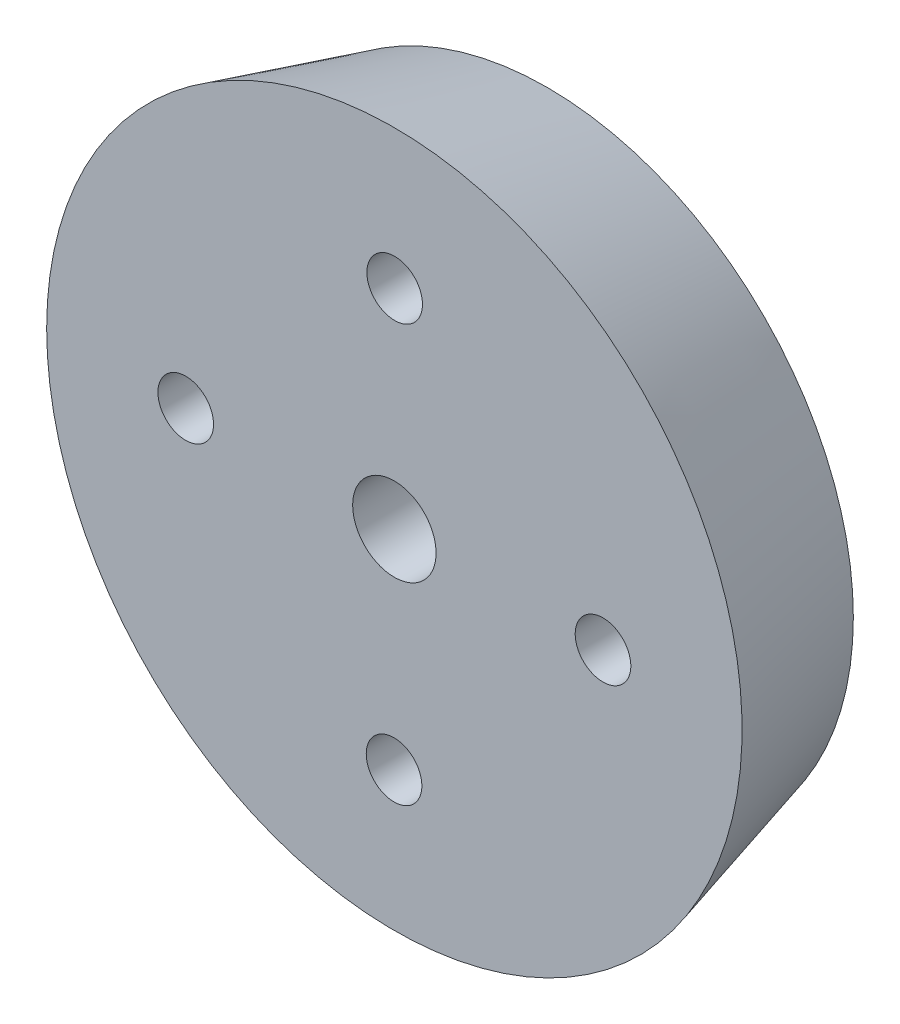
ISO-10303-21;
HEADER;
FILE_DESCRIPTION(('STEP AP214'),'2;1');
FILE_NAME('part.step','',(''),(''),'','','');
FILE_SCHEMA(('AUTOMOTIVE_DESIGN { 1 0 10303 214 1 1 1 1 }'));
ENDSEC;
DATA;
#1=APPLICATION_CONTEXT('core data for automotive mechanical design processes');
#2=APPLICATION_PROTOCOL_DEFINITION('international standard','automotive_design',2000,#1);
#3=PRODUCT_CONTEXT('',#1,'mechanical');
#4=PRODUCT('Part','Part','',(#3));
#5=PRODUCT_RELATED_PRODUCT_CATEGORY('part','',(#4));
#6=PRODUCT_DEFINITION_FORMATION('','',#4);
#7=PRODUCT_DEFINITION_CONTEXT('part definition',#1,'design');
#8=PRODUCT_DEFINITION('design','',#6,#7);
#9=PRODUCT_DEFINITION_SHAPE('','',#8);
#10=(LENGTH_UNIT() NAMED_UNIT(*) SI_UNIT(.MILLI.,.METRE.));
#11=(NAMED_UNIT(*) PLANE_ANGLE_UNIT() SI_UNIT($,.RADIAN.));
#12=(NAMED_UNIT(*) SI_UNIT($,.STERADIAN.) SOLID_ANGLE_UNIT());
#13=UNCERTAINTY_MEASURE_WITH_UNIT(LENGTH_MEASURE(1.E-05),#10,'distance_accuracy_value','');
#14=(GEOMETRIC_REPRESENTATION_CONTEXT(3) GLOBAL_UNCERTAINTY_ASSIGNED_CONTEXT((#13)) GLOBAL_UNIT_ASSIGNED_CONTEXT((#10,
#11,#12)) REPRESENTATION_CONTEXT('',''));
#15=CARTESIAN_POINT('',(0.,0.,0.));
#16=DIRECTION('',(0.,0.,1.));
#17=DIRECTION('',(1.,0.,0.));
#18=AXIS2_PLACEMENT_3D('',#15,#16,#17);
#19=CARTESIAN_POINT('',(25.,0.,-94.));
#20=DIRECTION('',(0.,0.,1.));
#21=DIRECTION('',(1.,0.,0.));
#22=AXIS2_PLACEMENT_3D('',#19,#20,#21);
#23=PLANE('',#22);
#24=CARTESIAN_POINT('',(0.,0.,-94.));
#25=DIRECTION('',(0.,0.,-1.));
#26=DIRECTION('',(-1.,0.,0.));
#27=AXIS2_PLACEMENT_3D('',#24,#25,#26);
#28=CIRCLE('',#27,3.);
#29=CARTESIAN_POINT('',(-3.,0.,-94.));
#30=VERTEX_POINT('',#29);
#31=EDGE_CURVE('E87',#30,#30,#28,.T.);
#32=ORIENTED_EDGE('',*,*,#31,.T.);
#33=EDGE_LOOP('',(#32));
#34=FACE_BOUND('',#33,.T.);
#35=CARTESIAN_POINT('',(0.,0.,-94.));
#36=DIRECTION('',(0.,0.,-1.));
#37=DIRECTION('',(-1.,0.,0.));
#38=AXIS2_PLACEMENT_3D('',#35,#36,#37);
#39=CIRCLE('',#38,25.);
#40=CARTESIAN_POINT('',(-25.,0.,-94.));
#41=VERTEX_POINT('',#40);
#42=EDGE_CURVE('E10',#41,#41,#39,.T.);
#43=ORIENTED_EDGE('',*,*,#42,.F.);
#44=EDGE_LOOP('',(#43));
#45=FACE_BOUND('',#44,.T.);
#46=CARTESIAN_POINT('',(-14.9999825658734,0.0228697068961115,-94.));
#47=DIRECTION('',(0.,0.,-1.));
#48=DIRECTION('',(-1.,0.,0.));
#49=AXIS2_PLACEMENT_3D('',#46,#47,#48);
#50=CIRCLE('',#49,1.99999999999999);
#51=CARTESIAN_POINT('',(-16.9999825658734,0.0228697068961115,-94.));
#52=VERTEX_POINT('',#51);
#53=EDGE_CURVE('E53',#52,#52,#50,.T.);
#54=ORIENTED_EDGE('',*,*,#53,.T.);
#55=EDGE_LOOP('',(#54));
#56=FACE_BOUND('',#55,.T.);
#57=CARTESIAN_POINT('',(0.0228697068961292,14.9999825658734,-94.));
#58=DIRECTION('',(0.,0.,-1.));
#59=DIRECTION('',(-1.,0.,0.));
#60=AXIS2_PLACEMENT_3D('',#57,#58,#59);
#61=CIRCLE('',#60,1.99999999999999);
#62=CARTESIAN_POINT('',(-1.97713029310386,14.9999825658734,-94.));
#63=VERTEX_POINT('',#62);
#64=EDGE_CURVE('E65',#63,#63,#61,.T.);
#65=ORIENTED_EDGE('',*,*,#64,.T.);
#66=EDGE_LOOP('',(#65));
#67=FACE_BOUND('',#66,.T.);
#68=CARTESIAN_POINT('',(-0.0228697068961825,-14.9999825658734,-94.));
#69=DIRECTION('',(0.,0.,-1.));
#70=DIRECTION('',(-1.,0.,0.));
#71=AXIS2_PLACEMENT_3D('',#68,#69,#70);
#72=CIRCLE('',#71,1.99999999999999);
#73=CARTESIAN_POINT('',(-2.02286970689617,-14.9999825658734,-94.));
#74=VERTEX_POINT('',#73);
#75=EDGE_CURVE('E72',#74,#74,#72,.T.);
#76=ORIENTED_EDGE('',*,*,#75,.T.);
#77=EDGE_LOOP('',(#76));
#78=FACE_BOUND('',#77,.T.);
#79=CARTESIAN_POINT('',(14.9999825658734,-0.0228697068961148,-94.));
#80=DIRECTION('',(0.,0.,-1.));
#81=DIRECTION('',(-1.,0.,0.));
#82=AXIS2_PLACEMENT_3D('',#79,#80,#81);
#83=CIRCLE('',#82,1.99999999999999);
#84=CARTESIAN_POINT('',(12.9999825658734,-0.0228697068961148,-94.));
#85=VERTEX_POINT('',#84);
#86=EDGE_CURVE('E79',#85,#85,#83,.T.);
#87=ORIENTED_EDGE('',*,*,#86,.T.);
#88=EDGE_LOOP('',(#87));
#89=FACE_BOUND('',#88,.T.);
#90=ADVANCED_FACE('F38',(#34,#45,#56,#67,#78,#89),#23,.T.);
#91=CARTESIAN_POINT('',(0.,0.,-105.));
#92=DIRECTION('',(0.,0.,1.));
#93=DIRECTION('',(1.,0.,0.));
#94=AXIS2_PLACEMENT_3D('',#91,#92,#93);
#95=CONICAL_SURFACE('',#94,22.,0.266252049150924);
#96=ORIENTED_EDGE('',*,*,#42,.T.);
#97=EDGE_LOOP('',(#96));
#98=FACE_BOUND('',#97,.T.);
#99=CARTESIAN_POINT('',(0.,0.,-105.));
#100=DIRECTION('',(0.,0.,-1.));
#101=DIRECTION('',(-1.,0.,0.));
#102=AXIS2_PLACEMENT_3D('',#99,#100,#101);
#103=CIRCLE('',#102,22.);
#104=CARTESIAN_POINT('',(-22.,0.,-105.));
#105=VERTEX_POINT('',#104);
#106=EDGE_CURVE('E46',#105,#105,#103,.T.);
#107=ORIENTED_EDGE('',*,*,#106,.F.);
#108=EDGE_LOOP('',(#107));
#109=FACE_BOUND('',#108,.T.);
#110=ADVANCED_FACE('F40',(#98,#109),#95,.T.);
#111=CARTESIAN_POINT('',(0.,0.,-105.));
#112=DIRECTION('',(0.,0.,-1.));
#113=DIRECTION('',(-1.,0.,0.));
#114=AXIS2_PLACEMENT_3D('',#111,#112,#113);
#115=PLANE('',#114);
#116=CARTESIAN_POINT('',(0.,0.,-105.));
#117=DIRECTION('',(0.,0.,-1.));
#118=DIRECTION('',(-1.,0.,0.));
#119=AXIS2_PLACEMENT_3D('',#116,#117,#118);
#120=CIRCLE('',#119,3.);
#121=CARTESIAN_POINT('',(-3.,0.,-105.));
#122=VERTEX_POINT('',#121);
#123=EDGE_CURVE('E88',#122,#122,#120,.T.);
#124=ORIENTED_EDGE('',*,*,#123,.F.);
#125=EDGE_LOOP('',(#124));
#126=FACE_BOUND('',#125,.T.);
#127=CARTESIAN_POINT('',(14.9999825658734,-0.0228697068961148,-105.));
#128=DIRECTION('',(0.,0.,-1.));
#129=DIRECTION('',(-1.,0.,0.));
#130=AXIS2_PLACEMENT_3D('',#127,#128,#129);
#131=CIRCLE('',#130,1.99999999999999);
#132=CARTESIAN_POINT('',(12.9999825658734,-0.0228697068961148,-105.));
#133=VERTEX_POINT('',#132);
#134=EDGE_CURVE('E83',#133,#133,#131,.T.);
#135=ORIENTED_EDGE('',*,*,#134,.F.);
#136=EDGE_LOOP('',(#135));
#137=FACE_BOUND('',#136,.T.);
#138=CARTESIAN_POINT('',(-0.0228697068961825,-14.9999825658734,-105.));
#139=DIRECTION('',(0.,0.,-1.));
#140=DIRECTION('',(-1.,0.,0.));
#141=AXIS2_PLACEMENT_3D('',#138,#139,#140);
#142=CIRCLE('',#141,1.99999999999999);
#143=CARTESIAN_POINT('',(-2.02286970689617,-14.9999825658734,-105.));
#144=VERTEX_POINT('',#143);
#145=EDGE_CURVE('E75',#144,#144,#142,.T.);
#146=ORIENTED_EDGE('',*,*,#145,.F.);
#147=EDGE_LOOP('',(#146));
#148=FACE_BOUND('',#147,.T.);
#149=CARTESIAN_POINT('',(0.0228697068961292,14.9999825658734,-105.));
#150=DIRECTION('',(0.,0.,-1.));
#151=DIRECTION('',(-1.,0.,0.));
#152=AXIS2_PLACEMENT_3D('',#149,#150,#151);
#153=CIRCLE('',#152,1.99999999999999);
#154=CARTESIAN_POINT('',(-1.97713029310386,14.9999825658734,-105.));
#155=VERTEX_POINT('',#154);
#156=EDGE_CURVE('E69',#155,#155,#153,.T.);
#157=ORIENTED_EDGE('',*,*,#156,.F.);
#158=EDGE_LOOP('',(#157));
#159=FACE_BOUND('',#158,.T.);
#160=CARTESIAN_POINT('',(-14.9999825658734,0.0228697068961115,-105.));
#161=DIRECTION('',(0.,0.,-1.));
#162=DIRECTION('',(-1.,0.,0.));
#163=AXIS2_PLACEMENT_3D('',#160,#161,#162);
#164=CIRCLE('',#163,1.99999999999999);
#165=CARTESIAN_POINT('',(-16.9999825658734,0.0228697068961115,-105.));
#166=VERTEX_POINT('',#165);
#167=EDGE_CURVE('E60',#166,#166,#164,.T.);
#168=ORIENTED_EDGE('',*,*,#167,.F.);
#169=EDGE_LOOP('',(#168));
#170=FACE_BOUND('',#169,.T.);
#171=ORIENTED_EDGE('',*,*,#106,.T.);
#172=EDGE_LOOP('',(#171));
#173=FACE_BOUND('',#172,.T.);
#174=ADVANCED_FACE('F104',(#126,#137,#148,#159,#170,#173),#115,.T.);
#175=CARTESIAN_POINT('',(-14.9999825658734,0.0228697068961115,-105.));
#176=DIRECTION('',(0.,0.,-1.));
#177=DIRECTION('',(-1.,0.,0.));
#178=AXIS2_PLACEMENT_3D('',#175,#176,#177);
#179=CYLINDRICAL_SURFACE('',#178,1.99999999999999);
#180=ORIENTED_EDGE('',*,*,#53,.F.);
#181=EDGE_LOOP('',(#180));
#182=FACE_BOUND('',#181,.T.);
#183=ORIENTED_EDGE('',*,*,#167,.T.);
#184=EDGE_LOOP('',(#183));
#185=FACE_BOUND('',#184,.T.);
#186=ADVANCED_FACE('F107',(#182,#185),#179,.F.);
#187=CARTESIAN_POINT('',(0.0228697068961292,14.9999825658734,-105.));
#188=DIRECTION('',(0.,0.,-1.));
#189=DIRECTION('',(-1.,0.,0.));
#190=AXIS2_PLACEMENT_3D('',#187,#188,#189);
#191=CYLINDRICAL_SURFACE('',#190,1.99999999999999);
#192=ORIENTED_EDGE('',*,*,#64,.F.);
#193=EDGE_LOOP('',(#192));
#194=FACE_BOUND('',#193,.T.);
#195=ORIENTED_EDGE('',*,*,#156,.T.);
#196=EDGE_LOOP('',(#195));
#197=FACE_BOUND('',#196,.T.);
#198=ADVANCED_FACE('F118',(#194,#197),#191,.F.);
#199=CARTESIAN_POINT('',(-0.0228697068961825,-14.9999825658734,-105.));
#200=DIRECTION('',(0.,0.,-1.));
#201=DIRECTION('',(-1.,0.,0.));
#202=AXIS2_PLACEMENT_3D('',#199,#200,#201);
#203=CYLINDRICAL_SURFACE('',#202,1.99999999999999);
#204=ORIENTED_EDGE('',*,*,#75,.F.);
#205=EDGE_LOOP('',(#204));
#206=FACE_BOUND('',#205,.T.);
#207=ORIENTED_EDGE('',*,*,#145,.T.);
#208=EDGE_LOOP('',(#207));
#209=FACE_BOUND('',#208,.T.);
#210=ADVANCED_FACE('F124',(#206,#209),#203,.F.);
#211=CARTESIAN_POINT('',(14.9999825658734,-0.0228697068961148,-105.));
#212=DIRECTION('',(0.,0.,-1.));
#213=DIRECTION('',(-1.,0.,0.));
#214=AXIS2_PLACEMENT_3D('',#211,#212,#213);
#215=CYLINDRICAL_SURFACE('',#214,1.99999999999999);
#216=ORIENTED_EDGE('',*,*,#86,.F.);
#217=EDGE_LOOP('',(#216));
#218=FACE_BOUND('',#217,.T.);
#219=ORIENTED_EDGE('',*,*,#134,.T.);
#220=EDGE_LOOP('',(#219));
#221=FACE_BOUND('',#220,.T.);
#222=ADVANCED_FACE('F100',(#218,#221),#215,.F.);
#223=CARTESIAN_POINT('',(0.,0.,-94.));
#224=DIRECTION('',(0.,0.,-1.));
#225=DIRECTION('',(-1.,0.,0.));
#226=AXIS2_PLACEMENT_3D('',#223,#224,#225);
#227=CYLINDRICAL_SURFACE('',#226,3.);
#228=ORIENTED_EDGE('',*,*,#31,.F.);
#229=EDGE_LOOP('',(#228));
#230=FACE_BOUND('',#229,.T.);
#231=ORIENTED_EDGE('',*,*,#123,.T.);
#232=EDGE_LOOP('',(#231));
#233=FACE_BOUND('',#232,.T.);
#234=ADVANCED_FACE('F97',(#230,#233),#227,.F.);
#235=CLOSED_SHELL('',(#90,#110,#174,#186,#198,#210,#222,#234));
#236=MANIFOLD_SOLID_BREP('B2',#235);
#237=ADVANCED_BREP_SHAPE_REPRESENTATION('',(#18,#236),#14);
#238=SHAPE_DEFINITION_REPRESENTATION(#9,#237);
ENDSEC;
END-ISO-10303-21;
